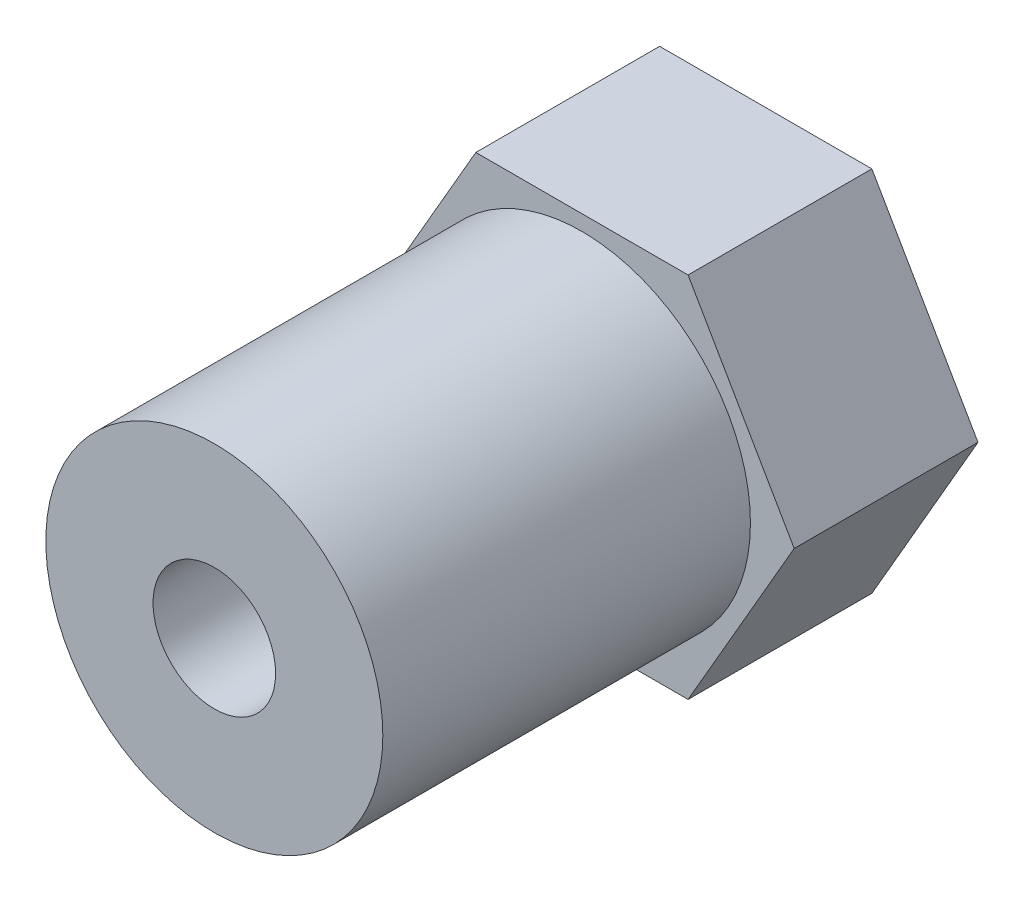
ISO-10303-21;
HEADER;
FILE_DESCRIPTION(('STEP AP214'),'2;1');
FILE_NAME('part.step','',(''),(''),'','','');
FILE_SCHEMA(('AUTOMOTIVE_DESIGN { 1 0 10303 214 1 1 1 1 }'));
ENDSEC;
DATA;
#1=APPLICATION_CONTEXT('core data for automotive mechanical design processes');
#2=APPLICATION_PROTOCOL_DEFINITION('international standard','automotive_design',2000,#1);
#3=PRODUCT_CONTEXT('',#1,'mechanical');
#4=PRODUCT('Part','Part','',(#3));
#5=PRODUCT_RELATED_PRODUCT_CATEGORY('part','',(#4));
#6=PRODUCT_DEFINITION_FORMATION('','',#4);
#7=PRODUCT_DEFINITION_CONTEXT('part definition',#1,'design');
#8=PRODUCT_DEFINITION('design','',#6,#7);
#9=PRODUCT_DEFINITION_SHAPE('','',#8);
#10=(LENGTH_UNIT() NAMED_UNIT(*) SI_UNIT(.MILLI.,.METRE.));
#11=(NAMED_UNIT(*) PLANE_ANGLE_UNIT() SI_UNIT($,.RADIAN.));
#12=(NAMED_UNIT(*) SI_UNIT($,.STERADIAN.) SOLID_ANGLE_UNIT());
#13=UNCERTAINTY_MEASURE_WITH_UNIT(LENGTH_MEASURE(1.E-05),#10,'distance_accuracy_value','');
#14=(GEOMETRIC_REPRESENTATION_CONTEXT(3) GLOBAL_UNCERTAINTY_ASSIGNED_CONTEXT((#13)) GLOBAL_UNIT_ASSIGNED_CONTEXT((#10,
#11,#12)) REPRESENTATION_CONTEXT('',''));
#15=CARTESIAN_POINT('',(0.,0.,0.));
#16=DIRECTION('',(0.,0.,1.));
#17=DIRECTION('',(1.,0.,0.));
#18=AXIS2_PLACEMENT_3D('',#15,#16,#17);
#19=CARTESIAN_POINT('',(0.,0.,6.));
#20=DIRECTION('',(0.,0.,1.));
#21=DIRECTION('',(1.,0.,0.));
#22=AXIS2_PLACEMENT_3D('',#19,#20,#21);
#23=PLANE('',#22);
#24=CARTESIAN_POINT('',(0.,0.,6.));
#25=DIRECTION('',(0.,0.,1.));
#26=DIRECTION('',(1.,0.,0.));
#27=AXIS2_PLACEMENT_3D('',#24,#25,#26);
#28=CIRCLE('',#27,5.5);
#29=CARTESIAN_POINT('',(5.5,0.,6.));
#30=VERTEX_POINT('',#29);
#31=EDGE_CURVE('E11',#30,#30,#28,.T.);
#32=ORIENTED_EDGE('',*,*,#31,.F.);
#33=EDGE_LOOP('',(#32));
#34=FACE_BOUND('',#33,.T.);
#35=DIRECTION('',(1.,0.,0.));
#36=VECTOR('',#35,1.);
#37=CARTESIAN_POINT('',(-3.46410161513776,-6.,6.));
#38=LINE('',#37,#36);
#39=CARTESIAN_POINT('',(-3.46410161513776,-6.,6.));
#40=VERTEX_POINT('',#39);
#41=CARTESIAN_POINT('',(3.46410161513775,-6.,6.));
#42=VERTEX_POINT('',#41);
#43=EDGE_CURVE('E131',#40,#42,#38,.T.);
#44=ORIENTED_EDGE('',*,*,#43,.T.);
#45=DIRECTION('',(0.5,0.866025403784439,0.));
#46=VECTOR('',#45,1.);
#47=CARTESIAN_POINT('',(3.46410161513775,-6.,6.));
#48=LINE('',#47,#46);
#49=CARTESIAN_POINT('',(6.92820323027551,0.,6.));
#50=VERTEX_POINT('',#49);
#51=EDGE_CURVE('E90',#42,#50,#48,.T.);
#52=ORIENTED_EDGE('',*,*,#51,.T.);
#53=DIRECTION('',(-0.5,0.866025403784439,0.));
#54=VECTOR('',#53,1.);
#55=CARTESIAN_POINT('',(6.92820323027551,0.,6.));
#56=LINE('',#55,#54);
#57=CARTESIAN_POINT('',(3.46410161513776,6.,6.));
#58=VERTEX_POINT('',#57);
#59=EDGE_CURVE('E102',#50,#58,#56,.T.);
#60=ORIENTED_EDGE('',*,*,#59,.T.);
#61=DIRECTION('',(-1.,0.,0.));
#62=VECTOR('',#61,1.);
#63=CARTESIAN_POINT('',(3.46410161513776,6.,6.));
#64=LINE('',#63,#62);
#65=CARTESIAN_POINT('',(-3.46410161513776,6.,6.));
#66=VERTEX_POINT('',#65);
#67=EDGE_CURVE('E97',#58,#66,#64,.T.);
#68=ORIENTED_EDGE('',*,*,#67,.T.);
#69=DIRECTION('',(-0.5,-0.866025403784439,0.));
#70=VECTOR('',#69,1.);
#71=CARTESIAN_POINT('',(-3.46410161513776,6.,6.));
#72=LINE('',#71,#70);
#73=CARTESIAN_POINT('',(-6.92820323027551,0.,6.));
#74=VERTEX_POINT('',#73);
#75=EDGE_CURVE('E100',#66,#74,#72,.T.);
#76=ORIENTED_EDGE('',*,*,#75,.T.);
#77=DIRECTION('',(0.5,-0.866025403784439,0.));
#78=VECTOR('',#77,1.);
#79=CARTESIAN_POINT('',(-6.92820323027551,0.,6.));
#80=LINE('',#79,#78);
#81=EDGE_CURVE('E52',#74,#40,#80,.T.);
#82=ORIENTED_EDGE('',*,*,#81,.T.);
#83=EDGE_LOOP('',(#44,#52,#60,#68,#76,#82));
#84=FACE_BOUND('',#83,.T.);
#85=ADVANCED_FACE('F34',(#34,#84),#23,.T.);
#86=CARTESIAN_POINT('',(0.,0.,0.));
#87=DIRECTION('',(0.,0.,1.));
#88=DIRECTION('',(1.,0.,0.));
#89=AXIS2_PLACEMENT_3D('',#86,#87,#88);
#90=PLANE('',#89);
#91=DIRECTION('',(1.,0.,0.));
#92=VECTOR('',#91,1.);
#93=CARTESIAN_POINT('',(-3.46410161513776,-6.,0.));
#94=LINE('',#93,#92);
#95=CARTESIAN_POINT('',(-3.46410161513776,-6.,0.));
#96=VERTEX_POINT('',#95);
#97=CARTESIAN_POINT('',(3.46410161513775,-6.,0.));
#98=VERTEX_POINT('',#97);
#99=EDGE_CURVE('E120',#96,#98,#94,.T.);
#100=ORIENTED_EDGE('',*,*,#99,.F.);
#101=DIRECTION('',(0.5,-0.866025403784439,0.));
#102=VECTOR('',#101,1.);
#103=CARTESIAN_POINT('',(-6.92820323027551,0.,0.));
#104=LINE('',#103,#102);
#105=CARTESIAN_POINT('',(-6.92820323027551,0.,0.));
#106=VERTEX_POINT('',#105);
#107=EDGE_CURVE('E81',#106,#96,#104,.T.);
#108=ORIENTED_EDGE('',*,*,#107,.F.);
#109=DIRECTION('',(-0.5,-0.866025403784439,0.));
#110=VECTOR('',#109,1.);
#111=CARTESIAN_POINT('',(-3.46410161513776,6.,0.));
#112=LINE('',#111,#110);
#113=CARTESIAN_POINT('',(-3.46410161513776,6.,0.));
#114=VERTEX_POINT('',#113);
#115=EDGE_CURVE('E75',#114,#106,#112,.T.);
#116=ORIENTED_EDGE('',*,*,#115,.F.);
#117=DIRECTION('',(-1.,0.,0.));
#118=VECTOR('',#117,1.);
#119=CARTESIAN_POINT('',(3.46410161513776,6.,0.));
#120=LINE('',#119,#118);
#121=CARTESIAN_POINT('',(3.46410161513776,6.,0.));
#122=VERTEX_POINT('',#121);
#123=EDGE_CURVE('E110',#122,#114,#120,.T.);
#124=ORIENTED_EDGE('',*,*,#123,.F.);
#125=DIRECTION('',(-0.5,0.866025403784439,0.));
#126=VECTOR('',#125,1.);
#127=CARTESIAN_POINT('',(6.92820323027551,0.,0.));
#128=LINE('',#127,#126);
#129=CARTESIAN_POINT('',(6.92820323027551,0.,0.));
#130=VERTEX_POINT('',#129);
#131=EDGE_CURVE('E126',#130,#122,#128,.T.);
#132=ORIENTED_EDGE('',*,*,#131,.F.);
#133=DIRECTION('',(0.5,0.866025403784439,0.));
#134=VECTOR('',#133,1.);
#135=CARTESIAN_POINT('',(3.46410161513775,-6.,0.));
#136=LINE('',#135,#134);
#137=EDGE_CURVE('E123',#98,#130,#136,.T.);
#138=ORIENTED_EDGE('',*,*,#137,.F.);
#139=EDGE_LOOP('',(#100,#108,#116,#124,#132,#138));
#140=FACE_BOUND('',#139,.T.);
#141=CARTESIAN_POINT('',(0.,0.,0.));
#142=DIRECTION('',(0.,0.,1.));
#143=DIRECTION('',(1.,0.,0.));
#144=AXIS2_PLACEMENT_3D('',#141,#142,#143);
#145=CIRCLE('',#144,2.);
#146=CARTESIAN_POINT('',(2.,0.,0.));
#147=VERTEX_POINT('',#146);
#148=EDGE_CURVE('E124',#147,#147,#145,.T.);
#149=ORIENTED_EDGE('',*,*,#148,.T.);
#150=EDGE_LOOP('',(#149));
#151=FACE_BOUND('',#150,.T.);
#152=ADVANCED_FACE('F144',(#140,#151),#90,.F.);
#153=CARTESIAN_POINT('',(-3.46410161513776,-6.,6.));
#154=DIRECTION('',(0.,1.,0.));
#155=DIRECTION('',(0.,0.,1.));
#156=AXIS2_PLACEMENT_3D('',#153,#154,#155);
#157=PLANE('',#156);
#158=ORIENTED_EDGE('',*,*,#99,.T.);
#159=DIRECTION('',(0.,0.,-1.));
#160=VECTOR('',#159,1.);
#161=CARTESIAN_POINT('',(3.46410161513775,-6.,6.));
#162=LINE('',#161,#160);
#163=EDGE_CURVE('E38',#42,#98,#162,.T.);
#164=ORIENTED_EDGE('',*,*,#163,.F.);
#165=ORIENTED_EDGE('',*,*,#43,.F.);
#166=DIRECTION('',(0.,0.,-1.));
#167=VECTOR('',#166,1.);
#168=CARTESIAN_POINT('',(-3.46410161513776,-6.,6.));
#169=LINE('',#168,#167);
#170=EDGE_CURVE('E116',#40,#96,#169,.T.);
#171=ORIENTED_EDGE('',*,*,#170,.T.);
#172=EDGE_LOOP('',(#158,#164,#165,#171));
#173=FACE_BOUND('',#172,.T.);
#174=ADVANCED_FACE('F36',(#173),#157,.F.);
#175=CARTESIAN_POINT('',(3.46410161513775,-6.,6.));
#176=DIRECTION('',(-0.866025403784438,0.5,0.));
#177=DIRECTION('',(-0.5,-0.866025403784439,0.));
#178=AXIS2_PLACEMENT_3D('',#175,#176,#177);
#179=PLANE('',#178);
#180=ORIENTED_EDGE('',*,*,#137,.T.);
#181=DIRECTION('',(0.,0.,-1.));
#182=VECTOR('',#181,1.);
#183=CARTESIAN_POINT('',(6.92820323027551,0.,6.));
#184=LINE('',#183,#182);
#185=EDGE_CURVE('E134',#50,#130,#184,.T.);
#186=ORIENTED_EDGE('',*,*,#185,.F.);
#187=ORIENTED_EDGE('',*,*,#51,.F.);
#188=ORIENTED_EDGE('',*,*,#163,.T.);
#189=EDGE_LOOP('',(#180,#186,#187,#188));
#190=FACE_BOUND('',#189,.T.);
#191=ADVANCED_FACE('F139',(#190),#179,.F.);
#192=CARTESIAN_POINT('',(6.92820323027551,0.,6.));
#193=DIRECTION('',(-0.866025403784439,-0.5,0.));
#194=DIRECTION('',(0.5,-0.866025403784439,0.));
#195=AXIS2_PLACEMENT_3D('',#192,#193,#194);
#196=PLANE('',#195);
#197=ORIENTED_EDGE('',*,*,#131,.T.);
#198=DIRECTION('',(0.,0.,-1.));
#199=VECTOR('',#198,1.);
#200=CARTESIAN_POINT('',(3.46410161513776,6.,6.));
#201=LINE('',#200,#199);
#202=EDGE_CURVE('E111',#58,#122,#201,.T.);
#203=ORIENTED_EDGE('',*,*,#202,.F.);
#204=ORIENTED_EDGE('',*,*,#59,.F.);
#205=ORIENTED_EDGE('',*,*,#185,.T.);
#206=EDGE_LOOP('',(#197,#203,#204,#205));
#207=FACE_BOUND('',#206,.T.);
#208=ADVANCED_FACE('F146',(#207),#196,.F.);
#209=CARTESIAN_POINT('',(3.46410161513776,6.,6.));
#210=DIRECTION('',(0.,-1.,0.));
#211=DIRECTION('',(1.,0.,0.));
#212=AXIS2_PLACEMENT_3D('',#209,#210,#211);
#213=PLANE('',#212);
#214=ORIENTED_EDGE('',*,*,#123,.T.);
#215=DIRECTION('',(0.,0.,-1.));
#216=VECTOR('',#215,1.);
#217=CARTESIAN_POINT('',(-3.46410161513776,6.,6.));
#218=LINE('',#217,#216);
#219=EDGE_CURVE('E107',#66,#114,#218,.T.);
#220=ORIENTED_EDGE('',*,*,#219,.F.);
#221=ORIENTED_EDGE('',*,*,#67,.F.);
#222=ORIENTED_EDGE('',*,*,#202,.T.);
#223=EDGE_LOOP('',(#214,#220,#221,#222));
#224=FACE_BOUND('',#223,.T.);
#225=ADVANCED_FACE('F108',(#224),#213,.F.);
#226=CARTESIAN_POINT('',(-3.46410161513776,6.,6.));
#227=DIRECTION('',(0.866025403784439,-0.5,0.));
#228=DIRECTION('',(0.5,0.866025403784439,0.));
#229=AXIS2_PLACEMENT_3D('',#226,#227,#228);
#230=PLANE('',#229);
#231=ORIENTED_EDGE('',*,*,#115,.T.);
#232=DIRECTION('',(0.,0.,-1.));
#233=VECTOR('',#232,1.);
#234=CARTESIAN_POINT('',(-6.92820323027551,0.,6.));
#235=LINE('',#234,#233);
#236=EDGE_CURVE('E112',#74,#106,#235,.T.);
#237=ORIENTED_EDGE('',*,*,#236,.F.);
#238=ORIENTED_EDGE('',*,*,#75,.F.);
#239=ORIENTED_EDGE('',*,*,#219,.T.);
#240=EDGE_LOOP('',(#231,#237,#238,#239));
#241=FACE_BOUND('',#240,.T.);
#242=ADVANCED_FACE('F114',(#241),#230,.F.);
#243=CARTESIAN_POINT('',(-6.92820323027551,0.,6.));
#244=DIRECTION('',(0.866025403784439,0.5,0.));
#245=DIRECTION('',(-0.5,0.866025403784439,0.));
#246=AXIS2_PLACEMENT_3D('',#243,#244,#245);
#247=PLANE('',#246);
#248=ORIENTED_EDGE('',*,*,#107,.T.);
#249=ORIENTED_EDGE('',*,*,#170,.F.);
#250=ORIENTED_EDGE('',*,*,#81,.F.);
#251=ORIENTED_EDGE('',*,*,#236,.T.);
#252=EDGE_LOOP('',(#248,#249,#250,#251));
#253=FACE_BOUND('',#252,.T.);
#254=ADVANCED_FACE('F172',(#253),#247,.F.);
#255=CARTESIAN_POINT('',(0.,0.,6.));
#256=DIRECTION('',(0.,0.,-1.));
#257=DIRECTION('',(-1.,0.,0.));
#258=AXIS2_PLACEMENT_3D('',#255,#256,#257);
#259=CYLINDRICAL_SURFACE('',#258,2.);
#260=ORIENTED_EDGE('',*,*,#148,.F.);
#261=EDGE_LOOP('',(#260));
#262=FACE_BOUND('',#261,.T.);
#263=CARTESIAN_POINT('',(0.,0.,18.));
#264=DIRECTION('',(0.,0.,1.));
#265=DIRECTION('',(1.,0.,0.));
#266=AXIS2_PLACEMENT_3D('',#263,#264,#265);
#267=CIRCLE('',#266,2.);
#268=CARTESIAN_POINT('',(2.,0.,18.));
#269=VERTEX_POINT('',#268);
#270=EDGE_CURVE('E155',#269,#269,#267,.T.);
#271=ORIENTED_EDGE('',*,*,#270,.T.);
#272=EDGE_LOOP('',(#271));
#273=FACE_BOUND('',#272,.T.);
#274=ADVANCED_FACE('F159',(#262,#273),#259,.F.);
#275=CARTESIAN_POINT('',(0.,0.,18.));
#276=DIRECTION('',(0.,0.,1.));
#277=DIRECTION('',(1.,0.,0.));
#278=AXIS2_PLACEMENT_3D('',#275,#276,#277);
#279=PLANE('',#278);
#280=CARTESIAN_POINT('',(0.,0.,18.));
#281=DIRECTION('',(0.,0.,1.));
#282=DIRECTION('',(1.,0.,0.));
#283=AXIS2_PLACEMENT_3D('',#280,#281,#282);
#284=CIRCLE('',#283,5.5);
#285=CARTESIAN_POINT('',(5.5,0.,18.));
#286=VERTEX_POINT('',#285);
#287=EDGE_CURVE('E151',#286,#286,#284,.T.);
#288=ORIENTED_EDGE('',*,*,#287,.T.);
#289=EDGE_LOOP('',(#288));
#290=FACE_BOUND('',#289,.T.);
#291=ORIENTED_EDGE('',*,*,#270,.F.);
#292=EDGE_LOOP('',(#291));
#293=FACE_BOUND('',#292,.T.);
#294=ADVANCED_FACE('F161',(#290,#293),#279,.T.);
#295=CARTESIAN_POINT('',(0.,0.,18.));
#296=DIRECTION('',(0.,0.,-1.));
#297=DIRECTION('',(-1.,0.,0.));
#298=AXIS2_PLACEMENT_3D('',#295,#296,#297);
#299=CYLINDRICAL_SURFACE('',#298,5.5);
#300=ORIENTED_EDGE('',*,*,#287,.F.);
#301=EDGE_LOOP('',(#300));
#302=FACE_BOUND('',#301,.T.);
#303=ORIENTED_EDGE('',*,*,#31,.T.);
#304=EDGE_LOOP('',(#303));
#305=FACE_BOUND('',#304,.T.);
#306=ADVANCED_FACE('F163',(#302,#305),#299,.T.);
#307=CLOSED_SHELL('',(#85,#152,#174,#191,#208,#225,#242,#254,#274,#294,#306));
#308=MANIFOLD_SOLID_BREP('B2',#307);
#309=ADVANCED_BREP_SHAPE_REPRESENTATION('',(#18,#308),#14);
#310=SHAPE_DEFINITION_REPRESENTATION(#9,#309);
ENDSEC;
END-ISO-10303-21;
